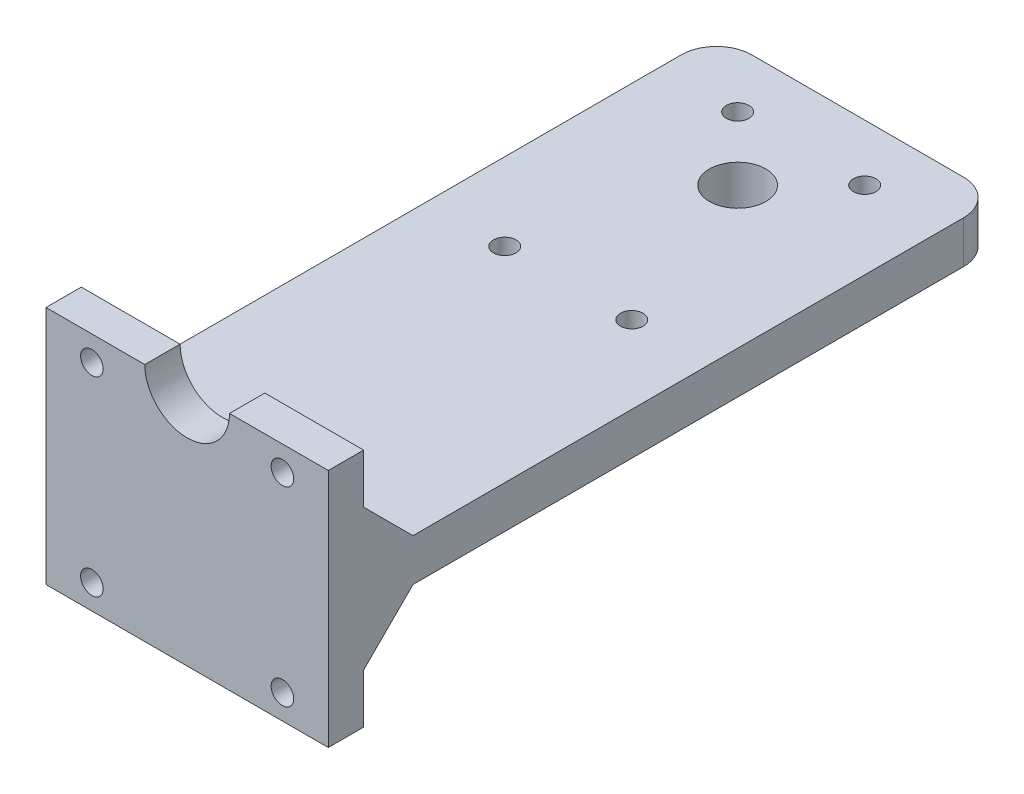
ISO-10303-21;
HEADER;
FILE_DESCRIPTION(('STEP AP214'),'2;1');
FILE_NAME('part.step','',(''),(''),'','','');
FILE_SCHEMA(('AUTOMOTIVE_DESIGN { 1 0 10303 214 1 1 1 1 }'));
ENDSEC;
DATA;
#1=APPLICATION_CONTEXT('core data for automotive mechanical design processes');
#2=APPLICATION_PROTOCOL_DEFINITION('international standard','automotive_design',2000,#1);
#3=PRODUCT_CONTEXT('',#1,'mechanical');
#4=PRODUCT('Part','Part','',(#3));
#5=PRODUCT_RELATED_PRODUCT_CATEGORY('part','',(#4));
#6=PRODUCT_DEFINITION_FORMATION('','',#4);
#7=PRODUCT_DEFINITION_CONTEXT('part definition',#1,'design');
#8=PRODUCT_DEFINITION('design','',#6,#7);
#9=PRODUCT_DEFINITION_SHAPE('','',#8);
#10=(LENGTH_UNIT() NAMED_UNIT(*) SI_UNIT(.MILLI.,.METRE.));
#11=(NAMED_UNIT(*) PLANE_ANGLE_UNIT() SI_UNIT($,.RADIAN.));
#12=(NAMED_UNIT(*) SI_UNIT($,.STERADIAN.) SOLID_ANGLE_UNIT());
#13=UNCERTAINTY_MEASURE_WITH_UNIT(LENGTH_MEASURE(1.E-05),#10,'distance_accuracy_value','');
#14=(GEOMETRIC_REPRESENTATION_CONTEXT(3) GLOBAL_UNCERTAINTY_ASSIGNED_CONTEXT((#13)) GLOBAL_UNIT_ASSIGNED_CONTEXT((#10,
#11,#12)) REPRESENTATION_CONTEXT('',''));
#15=CARTESIAN_POINT('',(0.,0.,0.));
#16=DIRECTION('',(0.,0.,1.));
#17=DIRECTION('',(1.,0.,0.));
#18=AXIS2_PLACEMENT_3D('',#15,#16,#17);
#19=CARTESIAN_POINT('',(0.,20.,0.));
#20=DIRECTION('',(0.,-1.,0.));
#21=DIRECTION('',(0.,0.,-1.));
#22=AXIS2_PLACEMENT_3D('',#19,#20,#21);
#23=PLANE('',#22);
#24=DIRECTION('',(1.,0.,0.));
#25=VECTOR('',#24,1.);
#26=CARTESIAN_POINT('',(-20.,20.,0.));
#27=LINE('',#26,#25);
#28=CARTESIAN_POINT('',(-20.,20.,0.));
#29=VERTEX_POINT('',#28);
#30=CARTESIAN_POINT('',(-5.99999999999999,20.,0.));
#31=VERTEX_POINT('',#30);
#32=EDGE_CURVE('E155',#29,#31,#27,.T.);
#33=ORIENTED_EDGE('',*,*,#32,.T.);
#34=DIRECTION('',(0.,0.,-1.));
#35=VECTOR('',#34,1.);
#36=CARTESIAN_POINT('',(-5.99999999999999,20.,9.));
#37=LINE('',#36,#35);
#38=CARTESIAN_POINT('',(-5.99999999999999,20.,-5.));
#39=VERTEX_POINT('',#38);
#40=EDGE_CURVE('E317',#31,#39,#37,.T.);
#41=ORIENTED_EDGE('',*,*,#40,.T.);
#42=DIRECTION('',(-1.,0.,0.));
#43=VECTOR('',#42,1.);
#44=CARTESIAN_POINT('',(-20.,20.,-5.));
#45=LINE('',#44,#43);
#46=CARTESIAN_POINT('',(-20.,20.,-5.));
#47=VERTEX_POINT('',#46);
#48=EDGE_CURVE('E240',#39,#47,#45,.T.);
#49=ORIENTED_EDGE('',*,*,#48,.T.);
#50=DIRECTION('',(0.,0.,1.));
#51=VECTOR('',#50,1.);
#52=CARTESIAN_POINT('',(-20.,20.,0.));
#53=LINE('',#52,#51);
#54=EDGE_CURVE('E231',#47,#29,#53,.T.);
#55=ORIENTED_EDGE('',*,*,#54,.T.);
#56=EDGE_LOOP('',(#33,#41,#49,#55));
#57=FACE_BOUND('',#56,.T.);
#58=ADVANCED_FACE('F40',(#57),#23,.F.);
#59=CARTESIAN_POINT('',(0.,6.,0.));
#60=DIRECTION('',(0.,-1.,0.));
#61=DIRECTION('',(0.,0.,-1.));
#62=AXIS2_PLACEMENT_3D('',#59,#60,#61);
#63=PLANE('',#62);
#64=CARTESIAN_POINT('',(9.,6.,-54.));
#65=DIRECTION('',(0.,1.,0.));
#66=DIRECTION('',(0.,0.,1.));
#67=AXIS2_PLACEMENT_3D('',#64,#65,#66);
#68=CIRCLE('',#67,1.6);
#69=CARTESIAN_POINT('',(9.,6.,-52.4));
#70=VERTEX_POINT('',#69);
#71=EDGE_CURVE('E254',#70,#70,#68,.T.);
#72=ORIENTED_EDGE('',*,*,#71,.F.);
#73=EDGE_LOOP('',(#72));
#74=FACE_BOUND('',#73,.T.);
#75=CARTESIAN_POINT('',(-9.,6.,-54.));
#76=DIRECTION('',(0.,1.,0.));
#77=DIRECTION('',(0.,0.,1.));
#78=AXIS2_PLACEMENT_3D('',#75,#76,#77);
#79=CIRCLE('',#78,1.6);
#80=CARTESIAN_POINT('',(-9.,6.,-52.4));
#81=VERTEX_POINT('',#80);
#82=EDGE_CURVE('E262',#81,#81,#79,.T.);
#83=ORIENTED_EDGE('',*,*,#82,.F.);
#84=EDGE_LOOP('',(#83));
#85=FACE_BOUND('',#84,.T.);
#86=CARTESIAN_POINT('',(9.,6.,-87.));
#87=DIRECTION('',(0.,1.,0.));
#88=DIRECTION('',(0.,0.,1.));
#89=AXIS2_PLACEMENT_3D('',#86,#87,#88);
#90=CIRCLE('',#89,1.6);
#91=CARTESIAN_POINT('',(9.,6.,-85.4));
#92=VERTEX_POINT('',#91);
#93=EDGE_CURVE('E270',#92,#92,#90,.T.);
#94=ORIENTED_EDGE('',*,*,#93,.F.);
#95=EDGE_LOOP('',(#94));
#96=FACE_BOUND('',#95,.T.);
#97=CARTESIAN_POINT('',(-9.,6.,-87.));
#98=DIRECTION('',(0.,1.,0.));
#99=DIRECTION('',(0.,0.,1.));
#100=AXIS2_PLACEMENT_3D('',#97,#98,#99);
#101=CIRCLE('',#100,1.6);
#102=CARTESIAN_POINT('',(-9.,6.,-85.4));
#103=VERTEX_POINT('',#102);
#104=EDGE_CURVE('E278',#103,#103,#101,.T.);
#105=ORIENTED_EDGE('',*,*,#104,.F.);
#106=EDGE_LOOP('',(#105));
#107=FACE_BOUND('',#106,.T.);
#108=CARTESIAN_POINT('',(0.,6.,-78.));
#109=DIRECTION('',(0.,1.,0.));
#110=DIRECTION('',(0.,0.,1.));
#111=AXIS2_PLACEMENT_3D('',#108,#109,#110);
#112=CIRCLE('',#111,4.);
#113=CARTESIAN_POINT('',(0.,6.,-74.));
#114=VERTEX_POINT('',#113);
#115=EDGE_CURVE('E286',#114,#114,#112,.T.);
#116=ORIENTED_EDGE('',*,*,#115,.F.);
#117=EDGE_LOOP('',(#116));
#118=FACE_BOUND('',#117,.T.);
#119=DIRECTION('',(0.,0.,-1.));
#120=VECTOR('',#119,1.);
#121=CARTESIAN_POINT('',(20.,6.,-95.));
#122=LINE('',#121,#120);
#123=CARTESIAN_POINT('',(20.,6.,-12.));
#124=VERTEX_POINT('',#123);
#125=CARTESIAN_POINT('',(20.,6.,-90.));
#126=VERTEX_POINT('',#125);
#127=EDGE_CURVE('E296',#124,#126,#122,.T.);
#128=ORIENTED_EDGE('',*,*,#127,.T.);
#129=CARTESIAN_POINT('',(15.,6.,-90.));
#130=DIRECTION('',(0.,-1.,0.));
#131=DIRECTION('',(0.,0.,-1.));
#132=AXIS2_PLACEMENT_3D('',#129,#130,#131);
#133=CIRCLE('',#132,5.);
#134=CARTESIAN_POINT('',(15.,6.,-95.));
#135=VERTEX_POINT('',#134);
#136=EDGE_CURVE('E50',#126,#135,#133,.F.);
#137=ORIENTED_EDGE('',*,*,#136,.T.);
#138=DIRECTION('',(-1.,0.,0.));
#139=VECTOR('',#138,1.);
#140=CARTESIAN_POINT('',(20.,6.,-95.));
#141=LINE('',#140,#139);
#142=CARTESIAN_POINT('',(-15.,6.,-95.));
#143=VERTEX_POINT('',#142);
#144=EDGE_CURVE('E301',#135,#143,#141,.T.);
#145=ORIENTED_EDGE('',*,*,#144,.T.);
#146=CARTESIAN_POINT('',(-15.,6.,-90.));
#147=DIRECTION('',(0.,-1.,0.));
#148=DIRECTION('',(0.,0.,-1.));
#149=AXIS2_PLACEMENT_3D('',#146,#147,#148);
#150=CIRCLE('',#149,5.);
#151=CARTESIAN_POINT('',(-20.,6.,-90.));
#152=VERTEX_POINT('',#151);
#153=EDGE_CURVE('E66',#143,#152,#150,.F.);
#154=ORIENTED_EDGE('',*,*,#153,.T.);
#155=DIRECTION('',(0.,0.,1.));
#156=VECTOR('',#155,1.);
#157=CARTESIAN_POINT('',(-20.,6.,-95.));
#158=LINE('',#157,#156);
#159=CARTESIAN_POINT('',(-20.,6.,-12.));
#160=VERTEX_POINT('',#159);
#161=EDGE_CURVE('E294',#152,#160,#158,.T.);
#162=ORIENTED_EDGE('',*,*,#161,.T.);
#163=DIRECTION('',(1.,0.,0.));
#164=VECTOR('',#163,1.);
#165=CARTESIAN_POINT('',(20.,6.,-12.));
#166=LINE('',#165,#164);
#167=EDGE_CURVE('E324',#160,#124,#166,.T.);
#168=ORIENTED_EDGE('',*,*,#167,.T.);
#169=EDGE_LOOP('',(#128,#137,#145,#154,#162,#168));
#170=FACE_BOUND('',#169,.T.);
#171=ADVANCED_FACE('F401',(#74,#85,#96,#107,#118,#170),#63,.F.);
#172=CARTESIAN_POINT('',(0.,0.,0.));
#173=DIRECTION('',(0.,-1.,0.));
#174=DIRECTION('',(0.,0.,-1.));
#175=AXIS2_PLACEMENT_3D('',#172,#173,#174);
#176=PLANE('',#175);
#177=DIRECTION('',(1.,0.,0.));
#178=VECTOR('',#177,1.);
#179=CARTESIAN_POINT('',(-20.,0.,-12.));
#180=LINE('',#179,#178);
#181=CARTESIAN_POINT('',(-20.,0.,-12.));
#182=VERTEX_POINT('',#181);
#183=CARTESIAN_POINT('',(20.,0.,-12.));
#184=VERTEX_POINT('',#183);
#185=EDGE_CURVE('E58',#182,#184,#180,.T.);
#186=ORIENTED_EDGE('',*,*,#185,.F.);
#187=DIRECTION('',(0.,0.,1.));
#188=VECTOR('',#187,1.);
#189=CARTESIAN_POINT('',(-20.,0.,-95.));
#190=LINE('',#189,#188);
#191=CARTESIAN_POINT('',(-20.,0.,-90.));
#192=VERTEX_POINT('',#191);
#193=EDGE_CURVE('E290',#192,#182,#190,.T.);
#194=ORIENTED_EDGE('',*,*,#193,.F.);
#195=CARTESIAN_POINT('',(-15.,0.,-90.));
#196=DIRECTION('',(0.,-1.,0.));
#197=DIRECTION('',(0.,0.,-1.));
#198=AXIS2_PLACEMENT_3D('',#195,#196,#197);
#199=CIRCLE('',#198,5.);
#200=CARTESIAN_POINT('',(-15.,0.,-95.));
#201=VERTEX_POINT('',#200);
#202=EDGE_CURVE('E341',#192,#201,#199,.T.);
#203=ORIENTED_EDGE('',*,*,#202,.T.);
#204=DIRECTION('',(-1.,0.,0.));
#205=VECTOR('',#204,1.);
#206=CARTESIAN_POINT('',(20.,0.,-95.));
#207=LINE('',#206,#205);
#208=CARTESIAN_POINT('',(15.,0.,-95.));
#209=VERTEX_POINT('',#208);
#210=EDGE_CURVE('E297',#209,#201,#207,.T.);
#211=ORIENTED_EDGE('',*,*,#210,.F.);
#212=CARTESIAN_POINT('',(15.,0.,-90.));
#213=DIRECTION('',(0.,-1.,0.));
#214=DIRECTION('',(0.,0.,-1.));
#215=AXIS2_PLACEMENT_3D('',#212,#213,#214);
#216=CIRCLE('',#215,5.);
#217=CARTESIAN_POINT('',(20.,0.,-90.));
#218=VERTEX_POINT('',#217);
#219=EDGE_CURVE('E344',#209,#218,#216,.T.);
#220=ORIENTED_EDGE('',*,*,#219,.T.);
#221=DIRECTION('',(0.,0.,-1.));
#222=VECTOR('',#221,1.);
#223=CARTESIAN_POINT('',(20.,0.,-95.));
#224=LINE('',#223,#222);
#225=EDGE_CURVE('E306',#184,#218,#224,.T.);
#226=ORIENTED_EDGE('',*,*,#225,.F.);
#227=EDGE_LOOP('',(#186,#194,#203,#211,#220,#226));
#228=FACE_BOUND('',#227,.T.);
#229=CARTESIAN_POINT('',(-9.,0.,-54.));
#230=DIRECTION('',(0.,1.,0.));
#231=DIRECTION('',(0.,0.,1.));
#232=AXIS2_PLACEMENT_3D('',#229,#230,#231);
#233=CIRCLE('',#232,1.6);
#234=CARTESIAN_POINT('',(-9.,0.,-52.4));
#235=VERTEX_POINT('',#234);
#236=EDGE_CURVE('E258',#235,#235,#233,.T.);
#237=ORIENTED_EDGE('',*,*,#236,.T.);
#238=EDGE_LOOP('',(#237));
#239=FACE_BOUND('',#238,.T.);
#240=CARTESIAN_POINT('',(-9.,0.,-87.));
#241=DIRECTION('',(0.,1.,0.));
#242=DIRECTION('',(0.,0.,1.));
#243=AXIS2_PLACEMENT_3D('',#240,#241,#242);
#244=CIRCLE('',#243,1.6);
#245=CARTESIAN_POINT('',(-9.,0.,-85.4));
#246=VERTEX_POINT('',#245);
#247=EDGE_CURVE('E274',#246,#246,#244,.T.);
#248=ORIENTED_EDGE('',*,*,#247,.T.);
#249=EDGE_LOOP('',(#248));
#250=FACE_BOUND('',#249,.T.);
#251=CARTESIAN_POINT('',(0.,0.,-78.));
#252=DIRECTION('',(0.,1.,0.));
#253=DIRECTION('',(0.,0.,1.));
#254=AXIS2_PLACEMENT_3D('',#251,#252,#253);
#255=CIRCLE('',#254,4.);
#256=CARTESIAN_POINT('',(0.,0.,-74.));
#257=VERTEX_POINT('',#256);
#258=EDGE_CURVE('E282',#257,#257,#255,.T.);
#259=ORIENTED_EDGE('',*,*,#258,.T.);
#260=EDGE_LOOP('',(#259));
#261=FACE_BOUND('',#260,.T.);
#262=CARTESIAN_POINT('',(9.,0.,-87.));
#263=DIRECTION('',(0.,1.,0.));
#264=DIRECTION('',(0.,0.,1.));
#265=AXIS2_PLACEMENT_3D('',#262,#263,#264);
#266=CIRCLE('',#265,1.6);
#267=CARTESIAN_POINT('',(9.,0.,-85.4));
#268=VERTEX_POINT('',#267);
#269=EDGE_CURVE('E266',#268,#268,#266,.T.);
#270=ORIENTED_EDGE('',*,*,#269,.T.);
#271=EDGE_LOOP('',(#270));
#272=FACE_BOUND('',#271,.T.);
#273=CARTESIAN_POINT('',(9.,0.,-54.));
#274=DIRECTION('',(0.,1.,0.));
#275=DIRECTION('',(0.,0.,1.));
#276=AXIS2_PLACEMENT_3D('',#273,#274,#275);
#277=CIRCLE('',#276,1.6);
#278=CARTESIAN_POINT('',(9.,0.,-52.4));
#279=VERTEX_POINT('',#278);
#280=EDGE_CURVE('E253',#279,#279,#277,.T.);
#281=ORIENTED_EDGE('',*,*,#280,.T.);
#282=EDGE_LOOP('',(#281));
#283=FACE_BOUND('',#282,.T.);
#284=ADVANCED_FACE('F408',(#228,#239,#250,#261,#272,#283),#176,.T.);
#285=CARTESIAN_POINT('',(-20.,6.,-95.));
#286=DIRECTION('',(1.,0.,0.));
#287=DIRECTION('',(0.,0.,-1.));
#288=AXIS2_PLACEMENT_3D('',#285,#286,#287);
#289=PLANE('',#288);
#290=ORIENTED_EDGE('',*,*,#161,.F.);
#291=DIRECTION('',(0.,-1.,0.));
#292=VECTOR('',#291,1.);
#293=CARTESIAN_POINT('',(-20.,6.,-90.));
#294=LINE('',#293,#292);
#295=EDGE_CURVE('E11',#152,#192,#294,.T.);
#296=ORIENTED_EDGE('',*,*,#295,.T.);
#297=ORIENTED_EDGE('',*,*,#193,.T.);
#298=DIRECTION('',(0.,0.707106781186551,-0.707106781186544));
#299=VECTOR('',#298,1.);
#300=CARTESIAN_POINT('',(-20.,0.,-12.));
#301=LINE('',#300,#299);
#302=CARTESIAN_POINT('',(-20.,-7.00000000000005,-4.99999999999999));
#303=VERTEX_POINT('',#302);
#304=EDGE_CURVE('E172',#303,#182,#301,.T.);
#305=ORIENTED_EDGE('',*,*,#304,.F.);
#306=DIRECTION('',(0.,1.,0.));
#307=VECTOR('',#306,1.);
#308=CARTESIAN_POINT('',(-20.,-7.00000000000005,-4.99999999999999));
#309=LINE('',#308,#307);
#310=CARTESIAN_POINT('',(-20.,-14.,-4.99999999999999));
#311=VERTEX_POINT('',#310);
#312=EDGE_CURVE('E178',#311,#303,#309,.T.);
#313=ORIENTED_EDGE('',*,*,#312,.F.);
#314=DIRECTION('',(0.,0.,-1.));
#315=VECTOR('',#314,1.);
#316=CARTESIAN_POINT('',(-20.,-14.,-4.99999999999999));
#317=LINE('',#316,#315);
#318=CARTESIAN_POINT('',(-20.,-14.,0.));
#319=VERTEX_POINT('',#318);
#320=EDGE_CURVE('E167',#319,#311,#317,.T.);
#321=ORIENTED_EDGE('',*,*,#320,.F.);
#322=DIRECTION('',(0.,-1.,0.));
#323=VECTOR('',#322,1.);
#324=CARTESIAN_POINT('',(-20.,6.,0.));
#325=LINE('',#324,#323);
#326=EDGE_CURVE('E146',#29,#319,#325,.T.);
#327=ORIENTED_EDGE('',*,*,#326,.F.);
#328=ORIENTED_EDGE('',*,*,#54,.F.);
#329=DIRECTION('',(0.,-1.,0.));
#330=VECTOR('',#329,1.);
#331=CARTESIAN_POINT('',(-20.,20.,-5.));
#332=LINE('',#331,#330);
#333=CARTESIAN_POINT('',(-20.,13.,-5.));
#334=VERTEX_POINT('',#333);
#335=EDGE_CURVE('E245',#47,#334,#332,.T.);
#336=ORIENTED_EDGE('',*,*,#335,.T.);
#337=DIRECTION('',(0.,0.707106781186551,0.707106781186544));
#338=VECTOR('',#337,1.);
#339=CARTESIAN_POINT('',(-20.,-35.5,-53.4999999999996));
#340=LINE('',#339,#338);
#341=EDGE_CURVE('E327',#334,#160,#340,.F.);
#342=ORIENTED_EDGE('',*,*,#341,.T.);
#343=EDGE_LOOP('',(#290,#296,#297,#305,#313,#321,#327,#328,#336,#342));
#344=FACE_BOUND('',#343,.T.);
#345=ADVANCED_FACE('F175',(#344),#289,.F.);
#346=CARTESIAN_POINT('',(20.,6.,0.));
#347=DIRECTION('',(0.,0.,-1.));
#348=DIRECTION('',(-1.,0.,0.));
#349=AXIS2_PLACEMENT_3D('',#346,#347,#348);
#350=PLANE('',#349);
#351=CARTESIAN_POINT('',(13.5,-10.5,0.));
#352=DIRECTION('',(0.,0.,1.));
#353=DIRECTION('',(-1.,0.,0.));
#354=AXIS2_PLACEMENT_3D('',#351,#352,#353);
#355=CIRCLE('',#354,1.6);
#356=CARTESIAN_POINT('',(11.9,-10.5,0.));
#357=VERTEX_POINT('',#356);
#358=EDGE_CURVE('E357',#357,#357,#355,.T.);
#359=ORIENTED_EDGE('',*,*,#358,.F.);
#360=EDGE_LOOP('',(#359));
#361=FACE_BOUND('',#360,.T.);
#362=CARTESIAN_POINT('',(-13.5,-10.5,0.));
#363=DIRECTION('',(0.,0.,1.));
#364=DIRECTION('',(-1.,0.,0.));
#365=AXIS2_PLACEMENT_3D('',#362,#363,#364);
#366=CIRCLE('',#365,1.6);
#367=CARTESIAN_POINT('',(-15.1,-10.5,0.));
#368=VERTEX_POINT('',#367);
#369=EDGE_CURVE('E191',#368,#368,#366,.T.);
#370=ORIENTED_EDGE('',*,*,#369,.F.);
#371=EDGE_LOOP('',(#370));
#372=FACE_BOUND('',#371,.T.);
#373=CARTESIAN_POINT('',(-13.5,16.5,0.));
#374=DIRECTION('',(0.,0.,-1.));
#375=DIRECTION('',(-1.,0.,0.));
#376=AXIS2_PLACEMENT_3D('',#373,#374,#375);
#377=CIRCLE('',#376,1.6);
#378=CARTESIAN_POINT('',(-15.1,16.5,0.));
#379=VERTEX_POINT('',#378);
#380=EDGE_CURVE('E221',#379,#379,#377,.T.);
#381=ORIENTED_EDGE('',*,*,#380,.T.);
#382=EDGE_LOOP('',(#381));
#383=FACE_BOUND('',#382,.T.);
#384=CARTESIAN_POINT('',(13.5,16.5,0.));
#385=DIRECTION('',(0.,0.,-1.));
#386=DIRECTION('',(-1.,0.,0.));
#387=AXIS2_PLACEMENT_3D('',#384,#385,#386);
#388=CIRCLE('',#387,1.6);
#389=CARTESIAN_POINT('',(11.9,16.5,0.));
#390=VERTEX_POINT('',#389);
#391=EDGE_CURVE('E214',#390,#390,#388,.T.);
#392=ORIENTED_EDGE('',*,*,#391,.T.);
#393=EDGE_LOOP('',(#392));
#394=FACE_BOUND('',#393,.T.);
#395=CARTESIAN_POINT('',(6.00000000000001,20.,0.));
#396=VERTEX_POINT('',#395);
#397=CARTESIAN_POINT('',(20.,20.,0.));
#398=VERTEX_POINT('',#397);
#399=EDGE_CURVE('E234',#396,#398,#27,.T.);
#400=ORIENTED_EDGE('',*,*,#399,.F.);
#401=CARTESIAN_POINT('',(0.,20.,0.));
#402=DIRECTION('',(0.,0.,-1.));
#403=DIRECTION('',(-1.,0.,0.));
#404=AXIS2_PLACEMENT_3D('',#401,#402,#403);
#405=CIRCLE('',#404,6.);
#406=EDGE_CURVE('E228',#396,#31,#405,.T.);
#407=ORIENTED_EDGE('',*,*,#406,.T.);
#408=ORIENTED_EDGE('',*,*,#32,.F.);
#409=ORIENTED_EDGE('',*,*,#326,.T.);
#410=DIRECTION('',(1.,0.,0.));
#411=VECTOR('',#410,1.);
#412=CARTESIAN_POINT('',(-20.,-14.,0.));
#413=LINE('',#412,#411);
#414=CARTESIAN_POINT('',(20.,-14.,0.));
#415=VERTEX_POINT('',#414);
#416=EDGE_CURVE('E151',#319,#415,#413,.T.);
#417=ORIENTED_EDGE('',*,*,#416,.T.);
#418=DIRECTION('',(0.,-1.,0.));
#419=VECTOR('',#418,1.);
#420=CARTESIAN_POINT('',(20.,6.,0.));
#421=LINE('',#420,#419);
#422=EDGE_CURVE('E162',#398,#415,#421,.T.);
#423=ORIENTED_EDGE('',*,*,#422,.F.);
#424=EDGE_LOOP('',(#400,#407,#408,#409,#417,#423));
#425=FACE_BOUND('',#424,.T.);
#426=ADVANCED_FACE('F149',(#361,#372,#383,#394,#425),#350,.F.);
#427=CARTESIAN_POINT('',(20.,6.,-95.));
#428=DIRECTION('',(-1.,0.,0.));
#429=DIRECTION('',(0.,0.,1.));
#430=AXIS2_PLACEMENT_3D('',#427,#428,#429);
#431=PLANE('',#430);
#432=ORIENTED_EDGE('',*,*,#422,.T.);
#433=DIRECTION('',(0.,0.,-1.));
#434=VECTOR('',#433,1.);
#435=CARTESIAN_POINT('',(20.,-14.,-5.));
#436=LINE('',#435,#434);
#437=CARTESIAN_POINT('',(20.,-14.,-5.));
#438=VERTEX_POINT('',#437);
#439=EDGE_CURVE('E169',#415,#438,#436,.T.);
#440=ORIENTED_EDGE('',*,*,#439,.T.);
#441=DIRECTION('',(0.,1.,0.));
#442=VECTOR('',#441,1.);
#443=CARTESIAN_POINT('',(20.,-7.00000000000005,-5.));
#444=LINE('',#443,#442);
#445=CARTESIAN_POINT('',(20.,-7.00000000000005,-5.));
#446=VERTEX_POINT('',#445);
#447=EDGE_CURVE('E188',#438,#446,#444,.T.);
#448=ORIENTED_EDGE('',*,*,#447,.T.);
#449=DIRECTION('',(0.,0.707106781186551,-0.707106781186544));
#450=VECTOR('',#449,1.);
#451=CARTESIAN_POINT('',(20.,0.,-12.));
#452=LINE('',#451,#450);
#453=EDGE_CURVE('E180',#446,#184,#452,.T.);
#454=ORIENTED_EDGE('',*,*,#453,.T.);
#455=ORIENTED_EDGE('',*,*,#225,.T.);
#456=DIRECTION('',(0.,-1.,0.));
#457=VECTOR('',#456,1.);
#458=CARTESIAN_POINT('',(20.,6.,-90.));
#459=LINE('',#458,#457);
#460=EDGE_CURVE('E348',#218,#126,#459,.F.);
#461=ORIENTED_EDGE('',*,*,#460,.T.);
#462=ORIENTED_EDGE('',*,*,#127,.F.);
#463=DIRECTION('',(0.,-0.707106781186551,-0.707106781186544));
#464=VECTOR('',#463,1.);
#465=CARTESIAN_POINT('',(20.,-35.5,-53.4999999999996));
#466=LINE('',#465,#464);
#467=CARTESIAN_POINT('',(20.,13.,-5.));
#468=VERTEX_POINT('',#467);
#469=EDGE_CURVE('E331',#124,#468,#466,.F.);
#470=ORIENTED_EDGE('',*,*,#469,.T.);
#471=DIRECTION('',(0.,-1.,0.));
#472=VECTOR('',#471,1.);
#473=CARTESIAN_POINT('',(20.,20.,-5.));
#474=LINE('',#473,#472);
#475=CARTESIAN_POINT('',(20.,20.,-5.));
#476=VERTEX_POINT('',#475);
#477=EDGE_CURVE('E249',#476,#468,#474,.T.);
#478=ORIENTED_EDGE('',*,*,#477,.F.);
#479=DIRECTION('',(0.,0.,-1.));
#480=VECTOR('',#479,1.);
#481=CARTESIAN_POINT('',(20.,20.,0.));
#482=LINE('',#481,#480);
#483=EDGE_CURVE('E237',#398,#476,#482,.T.);
#484=ORIENTED_EDGE('',*,*,#483,.F.);
#485=EDGE_LOOP('',(#432,#440,#448,#454,#455,#461,#462,#470,#478,#484));
#486=FACE_BOUND('',#485,.T.);
#487=ADVANCED_FACE('F376',(#486),#431,.F.);
#488=CARTESIAN_POINT('',(20.,6.,-95.));
#489=DIRECTION('',(0.,0.,1.));
#490=DIRECTION('',(1.,0.,0.));
#491=AXIS2_PLACEMENT_3D('',#488,#489,#490);
#492=PLANE('',#491);
#493=ORIENTED_EDGE('',*,*,#144,.F.);
#494=DIRECTION('',(0.,-1.,0.));
#495=VECTOR('',#494,1.);
#496=CARTESIAN_POINT('',(15.,6.,-95.));
#497=LINE('',#496,#495);
#498=EDGE_CURVE('E337',#135,#209,#497,.T.);
#499=ORIENTED_EDGE('',*,*,#498,.T.);
#500=ORIENTED_EDGE('',*,*,#210,.T.);
#501=DIRECTION('',(0.,-1.,0.));
#502=VECTOR('',#501,1.);
#503=CARTESIAN_POINT('',(-15.,6.,-95.));
#504=LINE('',#503,#502);
#505=EDGE_CURVE('E334',#201,#143,#504,.F.);
#506=ORIENTED_EDGE('',*,*,#505,.T.);
#507=EDGE_LOOP('',(#493,#499,#500,#506));
#508=FACE_BOUND('',#507,.T.);
#509=ADVANCED_FACE('F440',(#508),#492,.F.);
#510=CARTESIAN_POINT('',(0.,6.,-78.));
#511=DIRECTION('',(0.,-1.,0.));
#512=DIRECTION('',(0.,0.,-1.));
#513=AXIS2_PLACEMENT_3D('',#510,#511,#512);
#514=CYLINDRICAL_SURFACE('',#513,4.);
#515=ORIENTED_EDGE('',*,*,#115,.T.);
#516=EDGE_LOOP('',(#515));
#517=FACE_BOUND('',#516,.T.);
#518=ORIENTED_EDGE('',*,*,#258,.F.);
#519=EDGE_LOOP('',(#518));
#520=FACE_BOUND('',#519,.T.);
#521=ADVANCED_FACE('F567',(#517,#520),#514,.F.);
#522=CARTESIAN_POINT('',(-9.,6.,-87.));
#523=DIRECTION('',(0.,-1.,0.));
#524=DIRECTION('',(0.,0.,-1.));
#525=AXIS2_PLACEMENT_3D('',#522,#523,#524);
#526=CYLINDRICAL_SURFACE('',#525,1.6);
#527=ORIENTED_EDGE('',*,*,#104,.T.);
#528=EDGE_LOOP('',(#527));
#529=FACE_BOUND('',#528,.T.);
#530=ORIENTED_EDGE('',*,*,#247,.F.);
#531=EDGE_LOOP('',(#530));
#532=FACE_BOUND('',#531,.T.);
#533=ADVANCED_FACE('F558',(#529,#532),#526,.F.);
#534=CARTESIAN_POINT('',(9.,6.,-87.));
#535=DIRECTION('',(0.,-1.,0.));
#536=DIRECTION('',(0.,0.,-1.));
#537=AXIS2_PLACEMENT_3D('',#534,#535,#536);
#538=CYLINDRICAL_SURFACE('',#537,1.6);
#539=ORIENTED_EDGE('',*,*,#93,.T.);
#540=EDGE_LOOP('',(#539));
#541=FACE_BOUND('',#540,.T.);
#542=ORIENTED_EDGE('',*,*,#269,.F.);
#543=EDGE_LOOP('',(#542));
#544=FACE_BOUND('',#543,.T.);
#545=ADVANCED_FACE('F549',(#541,#544),#538,.F.);
#546=CARTESIAN_POINT('',(-9.,6.,-54.));
#547=DIRECTION('',(0.,-1.,0.));
#548=DIRECTION('',(0.,0.,-1.));
#549=AXIS2_PLACEMENT_3D('',#546,#547,#548);
#550=CYLINDRICAL_SURFACE('',#549,1.6);
#551=ORIENTED_EDGE('',*,*,#82,.T.);
#552=EDGE_LOOP('',(#551));
#553=FACE_BOUND('',#552,.T.);
#554=ORIENTED_EDGE('',*,*,#236,.F.);
#555=EDGE_LOOP('',(#554));
#556=FACE_BOUND('',#555,.T.);
#557=ADVANCED_FACE('F540',(#553,#556),#550,.F.);
#558=CARTESIAN_POINT('',(9.,6.,-54.));
#559=DIRECTION('',(0.,-1.,0.));
#560=DIRECTION('',(0.,0.,-1.));
#561=AXIS2_PLACEMENT_3D('',#558,#559,#560);
#562=CYLINDRICAL_SURFACE('',#561,1.6);
#563=ORIENTED_EDGE('',*,*,#71,.T.);
#564=EDGE_LOOP('',(#563));
#565=FACE_BOUND('',#564,.T.);
#566=ORIENTED_EDGE('',*,*,#280,.F.);
#567=EDGE_LOOP('',(#566));
#568=FACE_BOUND('',#567,.T.);
#569=ADVANCED_FACE('F420',(#565,#568),#562,.F.);
#570=CARTESIAN_POINT('',(-20.,20.,-5.));
#571=DIRECTION('',(0.,0.,1.));
#572=DIRECTION('',(1.,0.,0.));
#573=AXIS2_PLACEMENT_3D('',#570,#571,#572);
#574=PLANE('',#573);
#575=CARTESIAN_POINT('',(-13.5,16.5,-5.));
#576=DIRECTION('',(0.,0.,-1.));
#577=DIRECTION('',(-1.,0.,0.));
#578=AXIS2_PLACEMENT_3D('',#575,#576,#577);
#579=CIRCLE('',#578,1.6);
#580=CARTESIAN_POINT('',(-15.1,16.5,-5.));
#581=VERTEX_POINT('',#580);
#582=EDGE_CURVE('E210',#581,#581,#579,.T.);
#583=ORIENTED_EDGE('',*,*,#582,.F.);
#584=EDGE_LOOP('',(#583));
#585=FACE_BOUND('',#584,.T.);
#586=CARTESIAN_POINT('',(13.5,16.5,-5.));
#587=DIRECTION('',(0.,0.,-1.));
#588=DIRECTION('',(-1.,0.,0.));
#589=AXIS2_PLACEMENT_3D('',#586,#587,#588);
#590=CIRCLE('',#589,1.6);
#591=CARTESIAN_POINT('',(11.9,16.5,-5.));
#592=VERTEX_POINT('',#591);
#593=EDGE_CURVE('E204',#592,#592,#590,.T.);
#594=ORIENTED_EDGE('',*,*,#593,.F.);
#595=EDGE_LOOP('',(#594));
#596=FACE_BOUND('',#595,.T.);
#597=ORIENTED_EDGE('',*,*,#477,.T.);
#598=DIRECTION('',(-1.,0.,0.));
#599=VECTOR('',#598,1.);
#600=CARTESIAN_POINT('',(-20.,13.,-5.));
#601=LINE('',#600,#599);
#602=EDGE_CURVE('E321',#468,#334,#601,.T.);
#603=ORIENTED_EDGE('',*,*,#602,.T.);
#604=ORIENTED_EDGE('',*,*,#335,.F.);
#605=ORIENTED_EDGE('',*,*,#48,.F.);
#606=CARTESIAN_POINT('',(0.,20.,-5.));
#607=DIRECTION('',(0.,0.,-1.));
#608=DIRECTION('',(-1.,0.,0.));
#609=AXIS2_PLACEMENT_3D('',#606,#607,#608);
#610=CIRCLE('',#609,6.);
#611=CARTESIAN_POINT('',(6.00000000000001,20.,-5.));
#612=VERTEX_POINT('',#611);
#613=EDGE_CURVE('E225',#612,#39,#610,.T.);
#614=ORIENTED_EDGE('',*,*,#613,.F.);
#615=EDGE_CURVE('E241',#476,#612,#45,.T.);
#616=ORIENTED_EDGE('',*,*,#615,.F.);
#617=EDGE_LOOP('',(#597,#603,#604,#605,#614,#616));
#618=FACE_BOUND('',#617,.T.);
#619=ADVANCED_FACE('F413',(#585,#596,#618),#574,.F.);
#620=ORIENTED_EDGE('',*,*,#615,.T.);
#621=DIRECTION('',(0.,0.,-1.));
#622=VECTOR('',#621,1.);
#623=CARTESIAN_POINT('',(6.00000000000001,20.,9.));
#624=LINE('',#623,#622);
#625=EDGE_CURVE('E161',#612,#396,#624,.F.);
#626=ORIENTED_EDGE('',*,*,#625,.T.);
#627=ORIENTED_EDGE('',*,*,#399,.T.);
#628=ORIENTED_EDGE('',*,*,#483,.T.);
#629=EDGE_LOOP('',(#620,#626,#627,#628));
#630=FACE_BOUND('',#629,.T.);
#631=ADVANCED_FACE('F404',(#630),#23,.F.);
#632=CARTESIAN_POINT('',(0.,20.,9.));
#633=DIRECTION('',(0.,0.,-1.));
#634=DIRECTION('',(-1.,0.,0.));
#635=AXIS2_PLACEMENT_3D('',#632,#633,#634);
#636=CYLINDRICAL_SURFACE('',#635,6.);
#637=ORIENTED_EDGE('',*,*,#406,.F.);
#638=ORIENTED_EDGE('',*,*,#625,.F.);
#639=ORIENTED_EDGE('',*,*,#613,.T.);
#640=ORIENTED_EDGE('',*,*,#40,.F.);
#641=EDGE_LOOP('',(#637,#638,#639,#640));
#642=FACE_BOUND('',#641,.T.);
#643=ADVANCED_FACE('F396',(#642),#636,.F.);
#644=CARTESIAN_POINT('',(-20.,13.,-5.));
#645=DIRECTION('',(0.,0.707106781186544,-0.707106781186551));
#646=DIRECTION('',(1.,0.,0.));
#647=AXIS2_PLACEMENT_3D('',#644,#645,#646);
#648=PLANE('',#647);
#649=ORIENTED_EDGE('',*,*,#469,.F.);
#650=ORIENTED_EDGE('',*,*,#167,.F.);
#651=ORIENTED_EDGE('',*,*,#341,.F.);
#652=ORIENTED_EDGE('',*,*,#602,.F.);
#653=EDGE_LOOP('',(#649,#650,#651,#652));
#654=FACE_BOUND('',#653,.T.);
#655=ADVANCED_FACE('F386',(#654),#648,.T.);
#656=CARTESIAN_POINT('',(13.5,16.5,9.));
#657=DIRECTION('',(0.,0.,-1.));
#658=DIRECTION('',(-1.,0.,0.));
#659=AXIS2_PLACEMENT_3D('',#656,#657,#658);
#660=CYLINDRICAL_SURFACE('',#659,1.6);
#661=ORIENTED_EDGE('',*,*,#593,.T.);
#662=EDGE_LOOP('',(#661));
#663=FACE_BOUND('',#662,.T.);
#664=ORIENTED_EDGE('',*,*,#391,.F.);
#665=EDGE_LOOP('',(#664));
#666=FACE_BOUND('',#665,.T.);
#667=ADVANCED_FACE('F383',(#663,#666),#660,.F.);
#668=CARTESIAN_POINT('',(-13.5,16.5,9.));
#669=DIRECTION('',(0.,0.,-1.));
#670=DIRECTION('',(-1.,0.,0.));
#671=AXIS2_PLACEMENT_3D('',#668,#669,#670);
#672=CYLINDRICAL_SURFACE('',#671,1.6);
#673=ORIENTED_EDGE('',*,*,#582,.T.);
#674=EDGE_LOOP('',(#673));
#675=FACE_BOUND('',#674,.T.);
#676=ORIENTED_EDGE('',*,*,#380,.F.);
#677=EDGE_LOOP('',(#676));
#678=FACE_BOUND('',#677,.T.);
#679=ADVANCED_FACE('F385',(#675,#678),#672,.F.);
#680=CARTESIAN_POINT('',(15.,6.,-90.));
#681=DIRECTION('',(0.,-1.,0.));
#682=DIRECTION('',(0.,0.,-1.));
#683=AXIS2_PLACEMENT_3D('',#680,#681,#682);
#684=CYLINDRICAL_SURFACE('',#683,5.);
#685=ORIENTED_EDGE('',*,*,#136,.F.);
#686=ORIENTED_EDGE('',*,*,#460,.F.);
#687=ORIENTED_EDGE('',*,*,#219,.F.);
#688=ORIENTED_EDGE('',*,*,#498,.F.);
#689=EDGE_LOOP('',(#685,#686,#687,#688));
#690=FACE_BOUND('',#689,.T.);
#691=ADVANCED_FACE('F393',(#690),#684,.T.);
#692=CARTESIAN_POINT('',(-15.,6.,-90.));
#693=DIRECTION('',(0.,-1.,0.));
#694=DIRECTION('',(0.,0.,-1.));
#695=AXIS2_PLACEMENT_3D('',#692,#693,#694);
#696=CYLINDRICAL_SURFACE('',#695,5.);
#697=ORIENTED_EDGE('',*,*,#153,.F.);
#698=ORIENTED_EDGE('',*,*,#505,.F.);
#699=ORIENTED_EDGE('',*,*,#202,.F.);
#700=ORIENTED_EDGE('',*,*,#295,.F.);
#701=EDGE_LOOP('',(#697,#698,#699,#700));
#702=FACE_BOUND('',#701,.T.);
#703=ADVANCED_FACE('F42',(#702),#696,.T.);
#704=CARTESIAN_POINT('',(-20.,0.,-12.));
#705=DIRECTION('',(0.,-0.707106781186544,-0.707106781186551));
#706=DIRECTION('',(0.,0.707106781186551,-0.707106781186544));
#707=AXIS2_PLACEMENT_3D('',#704,#705,#706);
#708=PLANE('',#707);
#709=ORIENTED_EDGE('',*,*,#453,.F.);
#710=DIRECTION('',(1.,0.,0.));
#711=VECTOR('',#710,1.);
#712=CARTESIAN_POINT('',(-20.,-7.00000000000005,-4.99999999999999));
#713=LINE('',#712,#711);
#714=EDGE_CURVE('E205',#303,#446,#713,.T.);
#715=ORIENTED_EDGE('',*,*,#714,.F.);
#716=ORIENTED_EDGE('',*,*,#304,.T.);
#717=ORIENTED_EDGE('',*,*,#185,.T.);
#718=EDGE_LOOP('',(#709,#715,#716,#717));
#719=FACE_BOUND('',#718,.T.);
#720=ADVANCED_FACE('F448',(#719),#708,.T.);
#721=CARTESIAN_POINT('',(-20.,-7.00000000000005,-4.99999999999999));
#722=DIRECTION('',(0.,0.,-1.));
#723=DIRECTION('',(-1.,0.,0.));
#724=AXIS2_PLACEMENT_3D('',#721,#722,#723);
#725=PLANE('',#724);
#726=CARTESIAN_POINT('',(13.5,-10.5,-5.));
#727=DIRECTION('',(0.,0.,-1.));
#728=DIRECTION('',(-1.,0.,0.));
#729=AXIS2_PLACEMENT_3D('',#726,#727,#728);
#730=CIRCLE('',#729,1.6);
#731=CARTESIAN_POINT('',(11.9,-10.5,-5.));
#732=VERTEX_POINT('',#731);
#733=EDGE_CURVE('E44',#732,#732,#730,.T.);
#734=ORIENTED_EDGE('',*,*,#733,.F.);
#735=EDGE_LOOP('',(#734));
#736=FACE_BOUND('',#735,.T.);
#737=CARTESIAN_POINT('',(-13.5,-10.5,-4.99999999999999));
#738=DIRECTION('',(0.,0.,-1.));
#739=DIRECTION('',(-1.,0.,0.));
#740=AXIS2_PLACEMENT_3D('',#737,#738,#739);
#741=CIRCLE('',#740,1.6);
#742=CARTESIAN_POINT('',(-15.1,-10.5,-4.99999999999999));
#743=VERTEX_POINT('',#742);
#744=EDGE_CURVE('E354',#743,#743,#741,.T.);
#745=ORIENTED_EDGE('',*,*,#744,.F.);
#746=EDGE_LOOP('',(#745));
#747=FACE_BOUND('',#746,.T.);
#748=ORIENTED_EDGE('',*,*,#447,.F.);
#749=DIRECTION('',(1.,0.,0.));
#750=VECTOR('',#749,1.);
#751=CARTESIAN_POINT('',(-20.,-14.,-4.99999999999999));
#752=LINE('',#751,#750);
#753=EDGE_CURVE('E171',#311,#438,#752,.T.);
#754=ORIENTED_EDGE('',*,*,#753,.F.);
#755=ORIENTED_EDGE('',*,*,#312,.T.);
#756=ORIENTED_EDGE('',*,*,#714,.T.);
#757=EDGE_LOOP('',(#748,#754,#755,#756));
#758=FACE_BOUND('',#757,.T.);
#759=ADVANCED_FACE('F451',(#736,#747,#758),#725,.T.);
#760=CARTESIAN_POINT('',(-20.,-14.,-4.99999999999999));
#761=DIRECTION('',(0.,-1.,0.));
#762=DIRECTION('',(0.,0.,-1.));
#763=AXIS2_PLACEMENT_3D('',#760,#761,#762);
#764=PLANE('',#763);
#765=ORIENTED_EDGE('',*,*,#439,.F.);
#766=ORIENTED_EDGE('',*,*,#416,.F.);
#767=ORIENTED_EDGE('',*,*,#320,.T.);
#768=ORIENTED_EDGE('',*,*,#753,.T.);
#769=EDGE_LOOP('',(#765,#766,#767,#768));
#770=FACE_BOUND('',#769,.T.);
#771=ADVANCED_FACE('F166',(#770),#764,.T.);
#772=CARTESIAN_POINT('',(-13.5,-10.5,-40.));
#773=DIRECTION('',(0.,0.,1.));
#774=DIRECTION('',(1.,0.,0.));
#775=AXIS2_PLACEMENT_3D('',#772,#773,#774);
#776=CYLINDRICAL_SURFACE('',#775,1.6);
#777=ORIENTED_EDGE('',*,*,#744,.T.);
#778=EDGE_LOOP('',(#777));
#779=FACE_BOUND('',#778,.T.);
#780=ORIENTED_EDGE('',*,*,#369,.T.);
#781=EDGE_LOOP('',(#780));
#782=FACE_BOUND('',#781,.T.);
#783=ADVANCED_FACE('F372',(#779,#782),#776,.F.);
#784=CARTESIAN_POINT('',(13.5,-10.5,-40.));
#785=DIRECTION('',(0.,0.,1.));
#786=DIRECTION('',(1.,0.,0.));
#787=AXIS2_PLACEMENT_3D('',#784,#785,#786);
#788=CYLINDRICAL_SURFACE('',#787,1.6);
#789=ORIENTED_EDGE('',*,*,#733,.T.);
#790=EDGE_LOOP('',(#789));
#791=FACE_BOUND('',#790,.T.);
#792=ORIENTED_EDGE('',*,*,#358,.T.);
#793=EDGE_LOOP('',(#792));
#794=FACE_BOUND('',#793,.T.);
#795=ADVANCED_FACE('F466',(#791,#794),#788,.F.);
#796=CLOSED_SHELL('',(#58,#171,#284,#345,#426,#487,#509,#521,#533,#545,#557,#569,#619,#631,#643,
#655,#667,#679,#691,#703,#720,#759,#771,#783,#795));
#797=MANIFOLD_SOLID_BREP('B2',#796);
#798=ADVANCED_BREP_SHAPE_REPRESENTATION('',(#18,#797),#14);
#799=SHAPE_DEFINITION_REPRESENTATION(#9,#798);
ENDSEC;
END-ISO-10303-21;
